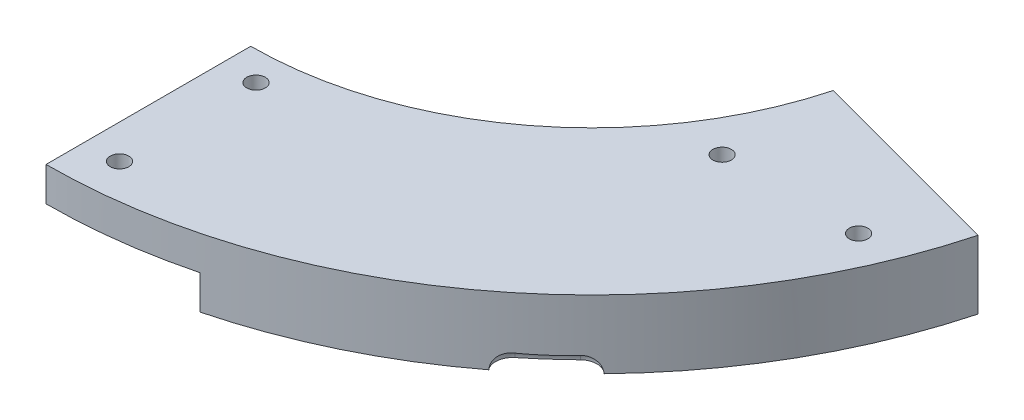
ISO-10303-21;
HEADER;
FILE_DESCRIPTION(('STEP AP214'),'2;1');
FILE_NAME('part.step','',(''),(''),'','','');
FILE_SCHEMA(('AUTOMOTIVE_DESIGN { 1 0 10303 214 1 1 1 1 }'));
ENDSEC;
DATA;
#1=APPLICATION_CONTEXT('core data for automotive mechanical design processes');
#2=APPLICATION_PROTOCOL_DEFINITION('international standard','automotive_design',2000,#1);
#3=PRODUCT_CONTEXT('',#1,'mechanical');
#4=PRODUCT('Part','Part','',(#3));
#5=PRODUCT_RELATED_PRODUCT_CATEGORY('part','',(#4));
#6=PRODUCT_DEFINITION_FORMATION('','',#4);
#7=PRODUCT_DEFINITION_CONTEXT('part definition',#1,'design');
#8=PRODUCT_DEFINITION('design','',#6,#7);
#9=PRODUCT_DEFINITION_SHAPE('','',#8);
#10=(LENGTH_UNIT() NAMED_UNIT(*) SI_UNIT(.MILLI.,.METRE.));
#11=(NAMED_UNIT(*) PLANE_ANGLE_UNIT() SI_UNIT($,.RADIAN.));
#12=(NAMED_UNIT(*) SI_UNIT($,.STERADIAN.) SOLID_ANGLE_UNIT());
#13=UNCERTAINTY_MEASURE_WITH_UNIT(LENGTH_MEASURE(1.E-05),#10,'distance_accuracy_value','');
#14=(GEOMETRIC_REPRESENTATION_CONTEXT(3) GLOBAL_UNCERTAINTY_ASSIGNED_CONTEXT((#13)) GLOBAL_UNIT_ASSIGNED_CONTEXT((#10,
#11,#12)) REPRESENTATION_CONTEXT('',''));
#15=CARTESIAN_POINT('',(0.,0.,0.));
#16=DIRECTION('',(0.,0.,1.));
#17=DIRECTION('',(1.,0.,0.));
#18=AXIS2_PLACEMENT_3D('',#15,#16,#17);
#19=CARTESIAN_POINT('',(0.,-6.35,0.));
#20=DIRECTION('',(0.,1.,0.));
#21=DIRECTION('',(0.,0.,1.));
#22=AXIS2_PLACEMENT_3D('',#19,#20,#21);
#23=PLANE('',#22);
#24=CARTESIAN_POINT('',(-6.34999999999999,-6.35,-94.267465262));
#25=DIRECTION('',(0.,1.,0.));
#26=DIRECTION('',(0.,0.,1.));
#27=AXIS2_PLACEMENT_3D('',#24,#25,#26);
#28=CIRCLE('',#27,101.6);
#29=CARTESIAN_POINT('',(91.7880639509695,-6.35,-67.9714502795843));
#30=VERTEX_POINT('',#29);
#31=CARTESIAN_POINT('',(66.609934624812,-6.35,-23.5609737669247));
#32=VERTEX_POINT('',#31);
#33=EDGE_CURVE('E161',#30,#32,#28,.F.);
#34=ORIENTED_EDGE('',*,*,#33,.T.);
#35=CARTESIAN_POINT('',(64.3650015378368,-6.35,-21.3157788010022));
#36=DIRECTION('',(0.,1.,0.));
#37=DIRECTION('',(0.,0.,1.));
#38=AXIS2_PLACEMENT_3D('',#35,#36,#37);
#39=CIRCLE('',#38,3.17500000000001);
#40=CARTESIAN_POINT('',(62.1551577397794,-6.35,-23.5955190029084));
#41=VERTEX_POINT('',#40);
#42=EDGE_CURVE('E147',#32,#41,#39,.T.);
#43=ORIENTED_EDGE('',*,*,#42,.T.);
#44=CARTESIAN_POINT('',(-6.34999999999999,-6.35,-94.267465262));
#45=DIRECTION('',(0.,1.,0.));
#46=DIRECTION('',(0.,0.,1.));
#47=AXIS2_PLACEMENT_3D('',#44,#45,#46);
#48=CIRCLE('',#47,98.425);
#49=CARTESIAN_POINT('',(55.7350089646732,-6.35,-17.8938291900122));
#50=VERTEX_POINT('',#49);
#51=EDGE_CURVE('E398',#41,#50,#48,.F.);
#52=ORIENTED_EDGE('',*,*,#51,.T.);
#53=CARTESIAN_POINT('',(57.7377511893401,-6.35,-15.4301635102706));
#54=DIRECTION('',(0.,1.,0.));
#55=DIRECTION('',(0.,0.,1.));
#56=AXIS2_PLACEMENT_3D('',#53,#54,#55);
#57=CIRCLE('',#56,3.175);
#58=CARTESIAN_POINT('',(55.2430934211356,-6.35,-13.4661605521423));
#59=VERTEX_POINT('',#58);
#60=EDGE_CURVE('E156',#50,#59,#57,.T.);
#61=ORIENTED_EDGE('',*,*,#60,.T.);
#62=CARTESIAN_POINT('',(19.05,-6.35,4.1063117316684));
#63=VERTEX_POINT('',#62);
#64=EDGE_CURVE('E170',#59,#63,#28,.F.);
#65=ORIENTED_EDGE('',*,*,#64,.T.);
#66=DIRECTION('',(0.,0.,-1.));
#67=VECTOR('',#66,1.);
#68=CARTESIAN_POINT('',(19.05,-6.35,0.));
#69=LINE('',#68,#67);
#70=CARTESIAN_POINT('',(19.05,-6.35000000000001,-9.32758866940955));
#71=VERTEX_POINT('',#70);
#72=EDGE_CURVE('E176',#63,#71,#69,.T.);
#73=ORIENTED_EDGE('',*,*,#72,.T.);
#74=CARTESIAN_POINT('',(59.2307860808822,-6.34999999999998,-34.6092496575072));
#75=CARTESIAN_POINT('',(53.9014840663634,-6.34999999999998,-28.753781836006));
#76=CARTESIAN_POINT('',(47.7126525344251,-6.34999999999998,-23.5402136265929));
#77=CARTESIAN_POINT('',(34.0840577834186,-6.34999999999998,-14.9609190133976));
#78=CARTESIAN_POINT('',(26.6877525453769,-6.34999999999671,-11.6096261559123));
#79=CARTESIAN_POINT('',(18.6746195889176,-6.35000000000014,-9.21543378527847));
#80=CARTESIAN_POINT('',(18.296166475289,-6.34999999999998,-9.10439786983044));
#81=CARTESIAN_POINT('',(17.9206079167567,-6.34999999999998,-8.99642515905449));
#82=B_SPLINE_CURVE_WITH_KNOTS('',3,(#74,#75,#76,#77,#78,#79,#80,#81),.UNSPECIFIED.,.F.,.F.,(4,2,
2,4),(0.,0.488007694164067,0.976015388328135,1.),.UNSPECIFIED.);
#83=CARTESIAN_POINT('',(59.2307860808822,-6.34999999999999,-34.6092496575072));
#84=VERTEX_POINT('',#83);
#85=EDGE_CURVE('E298',#84,#71,#82,.T.);
#86=ORIENTED_EDGE('',*,*,#85,.F.);
#87=DIRECTION('',(0.515920464794379,0.,0.856636488836631));
#88=VECTOR('',#87,1.);
#89=CARTESIAN_POINT('',(64.0430813094094,-6.35,-26.6188946142084));
#90=LINE('',#89,#88);
#91=CARTESIAN_POINT('',(54.063522539709,-6.35,-43.1889955657612));
#92=VERTEX_POINT('',#91);
#93=EDGE_CURVE('E306',#92,#84,#90,.T.);
#94=ORIENTED_EDGE('',*,*,#93,.F.);
#95=CARTESIAN_POINT('',(54.063522539709,-6.34999999999998,-43.1889955657612));
#96=CARTESIAN_POINT('',(49.5107747784138,-6.34999999999998,-37.8008034006709));
#97=CARTESIAN_POINT('',(44.1383057302959,-6.34999999999998,-32.9416564163539));
#98=CARTESIAN_POINT('',(32.2865263150446,-6.34999999999998,-24.8569769230008));
#99=CARTESIAN_POINT('',(25.7750626710049,-6.34999999999998,-21.6252465632108));
#100=CARTESIAN_POINT('',(18.7194764886662,-6.34999999999998,-19.2310542036305));
#101=CARTESIAN_POINT('',(18.3817175174875,-6.34999999999998,-19.1197151915227));
#102=CARTESIAN_POINT('',(18.0455634429701,-6.34999999999998,-19.011266069953));
#103=B_SPLINE_CURVE_WITH_KNOTS('',3,(#95,#96,#97,#98,#99,#100,#101,#102),.UNSPECIFIED.,.F.,.F.,
(4,2,2,4),(0.,0.488007694164067,0.976015388328135,1.),.UNSPECIFIED.);
#104=CARTESIAN_POINT('',(19.0499998347804,-6.35,-19.3432110988143));
#105=VERTEX_POINT('',#104);
#106=EDGE_CURVE('E76',#92,#105,#103,.T.);
#107=ORIENTED_EDGE('',*,*,#106,.T.);
#108=CARTESIAN_POINT('',(19.05,-6.35,-29.179965262));
#109=VERTEX_POINT('',#108);
#110=EDGE_CURVE('E254',#105,#109,#69,.T.);
#111=ORIENTED_EDGE('',*,*,#110,.T.);
#112=CARTESIAN_POINT('',(19.05,-6.35,-30.767465262));
#113=DIRECTION('',(0.,1.,0.));
#114=DIRECTION('',(0.,0.,1.));
#115=AXIS2_PLACEMENT_3D('',#112,#113,#114);
#116=CIRCLE('',#115,1.5875);
#117=CARTESIAN_POINT('',(17.6278728360681,-6.35,-31.472951321116));
#118=VERTEX_POINT('',#117);
#119=EDGE_CURVE('E257',#118,#109,#116,.F.);
#120=ORIENTED_EDGE('',*,*,#119,.F.);
#121=DIRECTION('',(-0.895828134760231,0.,-0.444400667159721));
#122=VECTOR('',#121,1.);
#123=CARTESIAN_POINT('',(16.0109533285498,-6.35,-32.2750695846567));
#124=LINE('',#123,#122);
#125=CARTESIAN_POINT('',(12.9770144535497,-6.35,-33.7801400416509));
#126=VERTEX_POINT('',#125);
#127=EDGE_CURVE('E197',#118,#126,#124,.T.);
#128=ORIENTED_EDGE('',*,*,#127,.T.);
#129=CARTESIAN_POINT('',(-6.34999999999999,-6.35,-94.267465262));
#130=DIRECTION('',(0.,1.,0.));
#131=DIRECTION('',(0.,0.,1.));
#132=AXIS2_PLACEMENT_3D('',#129,#130,#131);
#133=CIRCLE('',#132,63.5);
#134=CARTESIAN_POINT('',(54.9862899693559,-6.35,-77.8324558979902));
#135=VERTEX_POINT('',#134);
#136=EDGE_CURVE('E174',#135,#126,#133,.F.);
#137=ORIENTED_EDGE('',*,*,#136,.F.);
#138=DIRECTION('',(-0.965925826289069,0.,-0.258819045102517));
#139=VECTOR('',#138,1.);
#140=CARTESIAN_POINT('',(23.1414969725153,-6.35,-86.3652424646298));
#141=LINE('',#140,#139);
#142=EDGE_CURVE('E168',#30,#135,#141,.T.);
#143=ORIENTED_EDGE('',*,*,#142,.F.);
#144=EDGE_LOOP('',(#34,#43,#52,#61,#65,#73,#86,#94,#107,#111,#120,#128,#137,#143));
#145=FACE_BOUND('',#144,.T.);
#146=CARTESIAN_POINT('',(80.391,-6.35,-57.15));
#147=DIRECTION('',(0.,-1.,0.));
#148=DIRECTION('',(0.,0.,-1.));
#149=AXIS2_PLACEMENT_3D('',#146,#147,#148);
#150=CIRCLE('',#149,1.72719999999998);
#151=CARTESIAN_POINT('',(80.391,-6.35,-58.8772));
#152=VERTEX_POINT('',#151);
#153=EDGE_CURVE('E427',#152,#152,#150,.T.);
#154=ORIENTED_EDGE('',*,*,#153,.F.);
#155=EDGE_LOOP('',(#154));
#156=FACE_BOUND('',#155,.T.);
#157=CARTESIAN_POINT('',(54.991,-6.35,-57.15));
#158=DIRECTION('',(0.,-1.,0.));
#159=DIRECTION('',(0.,0.,-1.));
#160=AXIS2_PLACEMENT_3D('',#157,#158,#159);
#161=CIRCLE('',#160,1.72719999999999);
#162=CARTESIAN_POINT('',(54.991,-6.35,-58.8772));
#163=VERTEX_POINT('',#162);
#164=EDGE_CURVE('E435',#163,#163,#161,.T.);
#165=ORIENTED_EDGE('',*,*,#164,.F.);
#166=EDGE_LOOP('',(#165));
#167=FACE_BOUND('',#166,.T.);
#168=ADVANCED_FACE('F49',(#145,#156,#167),#23,.F.);
#169=CARTESIAN_POINT('',(19.05,-6.35,0.));
#170=DIRECTION('',(1.,0.,0.));
#171=DIRECTION('',(0.,0.,-1.));
#172=AXIS2_PLACEMENT_3D('',#169,#170,#171);
#173=PLANE('',#172);
#174=CARTESIAN_POINT('',(19.05,-6.34999999999998,-9.32759127987919));
#175=CARTESIAN_POINT('',(19.05,-6.34877044993828,-9.43975511956092));
#176=CARTESIAN_POINT('',(19.05,-6.34691619703676,-9.55193077200282));
#177=CARTESIAN_POINT('',(19.05,-6.34099239613251,-9.77726515650753));
#178=CARTESIAN_POINT('',(19.05,-6.33690239360589,-9.89042332273259));
#179=CARTESIAN_POINT('',(19.05,-6.3255017358533,-10.1171280988849));
#180=CARTESIAN_POINT('',(19.05,-6.31817588974514,-10.2306740040092));
#181=CARTESIAN_POINT('',(19.05,-6.29910536732891,-10.4575383845618));
#182=CARTESIAN_POINT('',(19.05,-6.28735576226616,-10.5708564640558));
#183=CARTESIAN_POINT('',(19.05,-6.25878012851775,-10.792168942808));
#184=CARTESIAN_POINT('',(19.05,-6.24218087419835,-10.9001918510583));
#185=CARTESIAN_POINT('',(19.05,-6.20277258175003,-11.1148203313904));
#186=CARTESIAN_POINT('',(19.05,-6.17998032744271,-11.2214289290464));
#187=CARTESIAN_POINT('',(19.05,-6.12743804971736,-11.432669678993));
#188=CARTESIAN_POINT('',(19.05,-6.09770431840141,-11.5373058485731));
#189=CARTESIAN_POINT('',(19.05,-6.03089201337944,-11.7441343909997));
#190=CARTESIAN_POINT('',(19.05,-5.99381898811404,-11.8463285449785));
#191=CARTESIAN_POINT('',(19.05,-5.92559448921612,-12.0151972175897));
#192=CARTESIAN_POINT('',(19.05,-5.89640437976236,-12.0826722141205));
#193=CARTESIAN_POINT('',(19.05,-5.83483658282869,-12.2162040070094));
#194=CARTESIAN_POINT('',(19.05,-5.80245694374324,-12.282259904565));
#195=CARTESIAN_POINT('',(19.05,-5.73474200887846,-12.4128013177297));
#196=CARTESIAN_POINT('',(19.05,-5.699407864708,-12.4772874326718));
#197=CARTESIAN_POINT('',(19.05,-5.62588151295779,-12.6049654701701));
#198=CARTESIAN_POINT('',(19.05,-5.5876780601153,-12.6681509163208));
#199=CARTESIAN_POINT('',(19.05,-5.50876580347631,-12.7929237672376));
#200=CARTESIAN_POINT('',(19.05,-5.46805698622041,-12.8545111634161));
#201=CARTESIAN_POINT('',(19.05,-5.38560136866745,-12.9769895708319));
#202=CARTESIAN_POINT('',(19.05,-5.343854367624,-13.0378804440114));
#203=CARTESIAN_POINT('',(19.05,-5.26442749027631,-13.1542428387078));
#204=CARTESIAN_POINT('',(19.05,-5.22672578492974,-13.2096991614335));
#205=CARTESIAN_POINT('',(19.05,-5.15245577009184,-13.3213847345521));
#206=CARTESIAN_POINT('',(19.05,-5.11588761597703,-13.3776140893936));
#207=CARTESIAN_POINT('',(19.05,-5.04504274545358,-13.4913577568436));
#208=CARTESIAN_POINT('',(19.05,-5.01076135869607,-13.5488691091202));
#209=CARTESIAN_POINT('',(19.05,-4.94581968454603,-13.6658741605996));
#210=CARTESIAN_POINT('',(19.05,-4.91515686880926,-13.72536643799));
#211=CARTESIAN_POINT('',(19.05,-4.85812485743782,-13.8496229488073));
#212=CARTESIAN_POINT('',(19.05,-4.83199803778249,-13.9145038974147));
#213=CARTESIAN_POINT('',(19.05,-4.79969194226115,-14.0140103700586));
#214=CARTESIAN_POINT('',(19.05,-4.790075334711,-14.0475168825955));
#215=CARTESIAN_POINT('',(19.05,-4.77360863456636,-14.1152117216461));
#216=CARTESIAN_POINT('',(19.05,-4.76675795713493,-14.1493999024197));
#217=CARTESIAN_POINT('',(19.05,-4.75706545039511,-14.2133029068063));
#218=CARTESIAN_POINT('',(19.05,-4.75378751840878,-14.2429506243572));
#219=CARTESIAN_POINT('',(19.05,-4.74992970234322,-14.3024139100861));
#220=CARTESIAN_POINT('',(19.05,-4.74934872913819,-14.3322294056383));
#221=CARTESIAN_POINT('',(19.05,-4.75182059526889,-14.4214142277704));
#222=CARTESIAN_POINT('',(19.05,-4.75906226125519,-14.4806839274736));
#223=CARTESIAN_POINT('',(19.05,-4.78757401654163,-14.6238848869327));
#224=CARTESIAN_POINT('',(19.05,-4.81372536447771,-14.7067765502434));
#225=CARTESIAN_POINT('',(19.05,-4.86164012074288,-14.8278629908574));
#226=CARTESIAN_POINT('',(19.05,-4.87918561175012,-14.8679030807019));
#227=CARTESIAN_POINT('',(19.05,-4.91652810011912,-14.9469032558564));
#228=CARTESIAN_POINT('',(19.05,-4.93632365352685,-14.9858640140702));
#229=CARTESIAN_POINT('',(19.05,-4.98011961530697,-15.0675334919055));
#230=CARTESIAN_POINT('',(19.05,-5.00433874289198,-15.1101229729653));
#231=CARTESIAN_POINT('',(19.05,-5.05431162869136,-15.1943965989881));
#232=CARTESIAN_POINT('',(19.05,-5.08006568384121,-15.2360805666353));
#233=CARTESIAN_POINT('',(19.05,-5.15893743845551,-15.3602360841168));
#234=CARTESIAN_POINT('',(19.05,-5.21360756423976,-15.4417104588864));
#235=CARTESIAN_POINT('',(19.05,-5.29639571516648,-15.5634645692969));
#236=CARTESIAN_POINT('',(19.05,-5.32414629891594,-15.6040074659781));
#237=CARTESIAN_POINT('',(19.05,-5.37953878549608,-15.6851715569525));
#238=CARTESIAN_POINT('',(19.05,-5.40718068510752,-15.7257927535127));
#239=CARTESIAN_POINT('',(19.05,-5.46199615984555,-15.8073883751621));
#240=CARTESIAN_POINT('',(19.05,-5.4891694387988,-15.8483630007325));
#241=CARTESIAN_POINT('',(19.05,-5.54253718739959,-15.9309449283161));
#242=CARTESIAN_POINT('',(19.05,-5.56873171855971,-15.9725521903371));
#243=CARTESIAN_POINT('',(19.05,-5.61954362028558,-16.0557998323216));
#244=CARTESIAN_POINT('',(19.05,-5.64417963704127,-16.0974288118073));
#245=CARTESIAN_POINT('',(19.05,-5.69227707343041,-16.1813613435385));
#246=CARTESIAN_POINT('',(19.05,-5.71573842689181,-16.2236649336101));
#247=CARTESIAN_POINT('',(19.05,-5.78426143731401,-16.3516261481783));
#248=CARTESIAN_POINT('',(19.05,-5.82744325539144,-16.4383036054415));
#249=CARTESIAN_POINT('',(19.05,-5.90826895682044,-16.6141382494852));
#250=CARTESIAN_POINT('',(19.05,-5.9459161908351,-16.7032938967552));
#251=CARTESIAN_POINT('',(19.05,-6.0153723510886,-16.883728164841));
#252=CARTESIAN_POINT('',(19.05,-6.04718852397859,-16.9750039895342));
#253=CARTESIAN_POINT('',(19.05,-6.09815420517401,-17.1374463040669));
#254=CARTESIAN_POINT('',(19.05,-6.11851696899575,-17.2082359991626));
#255=CARTESIAN_POINT('',(19.05,-6.15599581587932,-17.350672464299));
#256=CARTESIAN_POINT('',(19.05,-6.17311173894412,-17.4223192763918));
#257=CARTESIAN_POINT('',(19.05,-6.20430963450578,-17.5663336381067));
#258=CARTESIAN_POINT('',(19.05,-6.21838885287876,-17.6387017802318));
#259=CARTESIAN_POINT('',(19.05,-6.24378437073793,-17.7840156327186));
#260=CARTESIAN_POINT('',(19.05,-6.25509700085172,-17.8569619790708));
#261=CARTESIAN_POINT('',(19.05,-6.27526724099159,-18.0032815814091));
#262=CARTESIAN_POINT('',(19.05,-6.2841217823838,-18.0766552552952));
#263=CARTESIAN_POINT('',(19.05,-6.30033791486185,-18.2296630303017));
#264=CARTESIAN_POINT('',(19.05,-6.30751708297262,-18.3093162127117));
#265=CARTESIAN_POINT('',(19.05,-6.31980546301345,-18.4687530121299));
#266=CARTESIAN_POINT('',(19.05,-6.32491532103713,-18.5485365806043));
#267=CARTESIAN_POINT('',(19.05,-6.33346530599267,-18.7080501494635));
#268=CARTESIAN_POINT('',(19.05,-6.33690834883233,-18.7877799979509));
#269=CARTESIAN_POINT('',(19.05,-6.34249665501377,-18.9470020855166));
#270=CARTESIAN_POINT('',(19.05,-6.34464643971849,-19.0264941741518));
#271=CARTESIAN_POINT('',(19.05,-6.34796911453025,-19.1850615902752));
#272=CARTESIAN_POINT('',(19.05,-6.349147317236,-19.2641368030509));
#273=CARTESIAN_POINT('',(19.05,-6.34999999999998,-19.3432116977134));
#274=B_SPLINE_CURVE_WITH_KNOTS('',3,(#174,#175,#176,#177,#178,#179,#180,#181,#182,#183,#184,
#185,#186,#187,#188,#189,#190,#191,#192,#193,#194,#195,#196,#197,#198,#199,#200,#201,#202,#203,
#204,#205,#206,#207,#208,#209,#210,#211,#212,#213,#214,#215,#216,#217,#218,#219,#220,#221,#222,
#223,#224,#225,#226,#227,#228,#229,#230,#231,#232,#233,#234,#235,#236,#237,#238,#239,#240,#241,
#242,#243,#244,#245,#246,#247,#248,#249,#250,#251,#252,#253,#254,#255,#256,#257,#258,#259,#260,
#261,#262,#263,#264,#265,#266,#267,#268,#269,#270,#271,#272,#273),.UNSPECIFIED.,.F.,.F.,(4,2,2,
2,2,2,2,2,2,2,2,2,2,2,2,2,2,2,2,2,2,2,2,2,2,2,2,2,2,2,2,2,2,2,2,2,2,2,2,2,2,2,2,2,2,2,2,2,2,4),
(0.,0.33653894471456,0.676209654337335,1.01749220520341,1.35915612850659,1.68687464878332,
2.01371371910203,2.33979325492401,2.66562721247959,2.88610421286083,3.10671696647942,
3.32724412682608,3.54868585943983,3.77012878179348,3.99161486117681,4.19278570974306,
4.39398401206495,4.59475795350605,4.79539077033413,5.00468131198282,5.10916671579987,
5.21363001531121,5.30300516352542,5.39234421580322,5.57053841702862,5.82975187467556,
5.9608693111356,6.09190307442065,6.2388452307864,6.3858159063228,6.68010434116102,
6.82750058248743,6.97490115732465,7.1223917081208,7.26987297374777,7.41497097012355,
7.56007713109804,7.85039704617334,8.14054046994653,8.43032083104868,8.65122560558994,
8.87214126299623,9.09325644400447,9.31466332236302,9.53634537071466,9.77624018987288,
10.0160600496339,10.2554588414096,10.4940157314633,10.7312593800441),.UNSPECIFIED.);
#275=EDGE_CURVE('E190',#71,#105,#274,.T.);
#276=ORIENTED_EDGE('',*,*,#275,.F.);
#277=ORIENTED_EDGE('',*,*,#72,.F.);
#278=DIRECTION('',(0.,1.,0.));
#279=VECTOR('',#278,1.);
#280=CARTESIAN_POINT('',(19.05,-6.35,4.1063117316684));
#281=LINE('',#280,#279);
#282=CARTESIAN_POINT('',(19.05,0.,4.10631173166838));
#283=VERTEX_POINT('',#282);
#284=EDGE_CURVE('E203',#63,#283,#281,.T.);
#285=ORIENTED_EDGE('',*,*,#284,.T.);
#286=DIRECTION('',(0.,0.,-1.));
#287=VECTOR('',#286,1.);
#288=CARTESIAN_POINT('',(19.05,0.,0.));
#289=LINE('',#288,#287);
#290=CARTESIAN_POINT('',(19.05,0.,-29.179965262));
#291=VERTEX_POINT('',#290);
#292=EDGE_CURVE('E193',#283,#291,#289,.T.);
#293=ORIENTED_EDGE('',*,*,#292,.T.);
#294=DIRECTION('',(0.,1.,0.));
#295=VECTOR('',#294,1.);
#296=CARTESIAN_POINT('',(19.05,-6.35,-29.179965262));
#297=LINE('',#296,#295);
#298=EDGE_CURVE('E207',#109,#291,#297,.T.);
#299=ORIENTED_EDGE('',*,*,#298,.F.);
#300=ORIENTED_EDGE('',*,*,#110,.F.);
#301=EDGE_LOOP('',(#276,#277,#285,#293,#299,#300));
#302=FACE_BOUND('',#301,.T.);
#303=ADVANCED_FACE('F346',(#302),#173,.F.);
#304=CARTESIAN_POINT('',(0.,0.,0.));
#305=DIRECTION('',(0.,1.,0.));
#306=DIRECTION('',(0.,0.,1.));
#307=AXIS2_PLACEMENT_3D('',#304,#305,#306);
#308=PLANE('',#307);
#309=CARTESIAN_POINT('',(0.,0.,0.));
#310=DIRECTION('',(0.,1.,0.));
#311=DIRECTION('',(0.,0.,1.));
#312=AXIS2_PLACEMENT_3D('',#309,#310,#311);
#313=CIRCLE('',#312,1.72719999999999);
#314=CARTESIAN_POINT('',(0.,0.,1.72719999999999));
#315=VERTEX_POINT('',#314);
#316=EDGE_CURVE('E415',#315,#315,#313,.T.);
#317=ORIENTED_EDGE('',*,*,#316,.T.);
#318=EDGE_LOOP('',(#317));
#319=FACE_BOUND('',#318,.T.);
#320=CARTESIAN_POINT('',(0.,0.,-25.4));
#321=DIRECTION('',(0.,1.,0.));
#322=DIRECTION('',(0.,0.,1.));
#323=AXIS2_PLACEMENT_3D('',#320,#321,#322);
#324=CIRCLE('',#323,1.72719999999999);
#325=CARTESIAN_POINT('',(0.,0.,-23.6728));
#326=VERTEX_POINT('',#325);
#327=EDGE_CURVE('E403',#326,#326,#324,.T.);
#328=ORIENTED_EDGE('',*,*,#327,.T.);
#329=EDGE_LOOP('',(#328));
#330=FACE_BOUND('',#329,.T.);
#331=DIRECTION('',(-0.895828134760231,0.,-0.444400667159721));
#332=VECTOR('',#331,1.);
#333=CARTESIAN_POINT('',(16.0109533285498,0.,-32.2750695846567));
#334=LINE('',#333,#332);
#335=CARTESIAN_POINT('',(17.6278728360681,0.,-31.472951321116));
#336=VERTEX_POINT('',#335);
#337=CARTESIAN_POINT('',(12.9770144535497,0.,-33.7801400416509));
#338=VERTEX_POINT('',#337);
#339=EDGE_CURVE('E185',#336,#338,#334,.T.);
#340=ORIENTED_EDGE('',*,*,#339,.F.);
#341=CARTESIAN_POINT('',(19.05,0.,-30.767465262));
#342=DIRECTION('',(0.,1.,0.));
#343=DIRECTION('',(0.,0.,1.));
#344=AXIS2_PLACEMENT_3D('',#341,#342,#343);
#345=CIRCLE('',#344,1.5875);
#346=EDGE_CURVE('E189',#336,#291,#345,.F.);
#347=ORIENTED_EDGE('',*,*,#346,.T.);
#348=ORIENTED_EDGE('',*,*,#292,.F.);
#349=CARTESIAN_POINT('',(-6.34999999999999,0.,-94.267465262));
#350=DIRECTION('',(0.,1.,0.));
#351=DIRECTION('',(0.,0.,1.));
#352=AXIS2_PLACEMENT_3D('',#349,#350,#351);
#353=CIRCLE('',#352,101.6);
#354=CARTESIAN_POINT('',(-6.35,0.,7.332534738));
#355=VERTEX_POINT('',#354);
#356=EDGE_CURVE('E218',#283,#355,#353,.F.);
#357=ORIENTED_EDGE('',*,*,#356,.T.);
#358=DIRECTION('',(0.,0.,-1.));
#359=VECTOR('',#358,1.);
#360=CARTESIAN_POINT('',(-6.35,0.,0.));
#361=LINE('',#360,#359);
#362=CARTESIAN_POINT('',(-6.35,0.,-30.767465262));
#363=VERTEX_POINT('',#362);
#364=EDGE_CURVE('E232',#355,#363,#361,.T.);
#365=ORIENTED_EDGE('',*,*,#364,.T.);
#366=CARTESIAN_POINT('',(-6.34999999999999,0.,-94.267465262));
#367=DIRECTION('',(0.,1.,0.));
#368=DIRECTION('',(0.,0.,1.));
#369=AXIS2_PLACEMENT_3D('',#366,#367,#368);
#370=CIRCLE('',#369,63.5);
#371=EDGE_CURVE('E202',#338,#363,#370,.F.);
#372=ORIENTED_EDGE('',*,*,#371,.F.);
#373=EDGE_LOOP('',(#340,#347,#348,#357,#365,#372));
#374=FACE_BOUND('',#373,.T.);
#375=ADVANCED_FACE('F351',(#319,#330,#374),#308,.F.);
#376=CARTESIAN_POINT('',(-6.34999999999999,6.35,-94.267465262));
#377=DIRECTION('',(0.,-1.,0.));
#378=DIRECTION('',(0.,0.,-1.));
#379=AXIS2_PLACEMENT_3D('',#376,#377,#378);
#380=CYLINDRICAL_SURFACE('',#379,63.5);
#381=DIRECTION('',(0.,-1.,0.));
#382=VECTOR('',#381,1.);
#383=CARTESIAN_POINT('',(54.9862899693559,6.35,-77.8324558979902));
#384=LINE('',#383,#382);
#385=CARTESIAN_POINT('',(54.9862899693559,6.35,-77.8324558979902));
#386=VERTEX_POINT('',#385);
#387=EDGE_CURVE('E229',#386,#135,#384,.T.);
#388=ORIENTED_EDGE('',*,*,#387,.T.);
#389=ORIENTED_EDGE('',*,*,#136,.T.);
#390=DIRECTION('',(0.,1.,0.));
#391=VECTOR('',#390,1.);
#392=CARTESIAN_POINT('',(12.9770144535497,-6.35,-33.7801400416509));
#393=LINE('',#392,#391);
#394=EDGE_CURVE('E198',#126,#338,#393,.T.);
#395=ORIENTED_EDGE('',*,*,#394,.T.);
#396=ORIENTED_EDGE('',*,*,#371,.T.);
#397=DIRECTION('',(0.,-1.,0.));
#398=VECTOR('',#397,1.);
#399=CARTESIAN_POINT('',(-6.35,6.35,-30.767465262));
#400=LINE('',#399,#398);
#401=CARTESIAN_POINT('',(-6.35,6.35,-30.767465262));
#402=VERTEX_POINT('',#401);
#403=EDGE_CURVE('E247',#402,#363,#400,.T.);
#404=ORIENTED_EDGE('',*,*,#403,.F.);
#405=CARTESIAN_POINT('',(-6.34999999999999,6.35,-94.267465262));
#406=DIRECTION('',(0.,1.,0.));
#407=DIRECTION('',(0.,0.,1.));
#408=AXIS2_PLACEMENT_3D('',#405,#406,#407);
#409=CIRCLE('',#408,63.5);
#410=EDGE_CURVE('E214',#386,#402,#409,.F.);
#411=ORIENTED_EDGE('',*,*,#410,.F.);
#412=EDGE_LOOP('',(#388,#389,#395,#396,#404,#411));
#413=FACE_BOUND('',#412,.T.);
#414=ADVANCED_FACE('F51',(#413),#380,.F.);
#415=CARTESIAN_POINT('',(-6.35,6.35,0.));
#416=DIRECTION('',(-1.,0.,0.));
#417=DIRECTION('',(0.,0.,1.));
#418=AXIS2_PLACEMENT_3D('',#415,#416,#417);
#419=PLANE('',#418);
#420=ORIENTED_EDGE('',*,*,#364,.F.);
#421=DIRECTION('',(0.,-1.,0.));
#422=VECTOR('',#421,1.);
#423=CARTESIAN_POINT('',(-6.35,6.35,7.332534738));
#424=LINE('',#423,#422);
#425=CARTESIAN_POINT('',(-6.35,6.35,7.332534738));
#426=VERTEX_POINT('',#425);
#427=EDGE_CURVE('E243',#426,#355,#424,.T.);
#428=ORIENTED_EDGE('',*,*,#427,.F.);
#429=DIRECTION('',(0.,0.,-1.));
#430=VECTOR('',#429,1.);
#431=CARTESIAN_POINT('',(-6.35,6.35,0.));
#432=LINE('',#431,#430);
#433=EDGE_CURVE('E217',#426,#402,#432,.T.);
#434=ORIENTED_EDGE('',*,*,#433,.T.);
#435=ORIENTED_EDGE('',*,*,#403,.T.);
#436=EDGE_LOOP('',(#420,#428,#434,#435));
#437=FACE_BOUND('',#436,.T.);
#438=ADVANCED_FACE('F357',(#437),#419,.T.);
#439=CARTESIAN_POINT('',(-6.34999999999999,6.35,-94.267465262));
#440=DIRECTION('',(0.,-1.,0.));
#441=DIRECTION('',(0.,0.,-1.));
#442=AXIS2_PLACEMENT_3D('',#439,#440,#441);
#443=CYLINDRICAL_SURFACE('',#442,101.6);
#444=CARTESIAN_POINT('',(66.609934624812,-6.35,-23.5609737669247));
#445=CARTESIAN_POINT('',(66.6099322914893,-6.34994364609906,-23.5609713592381));
#446=CARTESIAN_POINT('',(66.6099299571175,-6.34988729228781,-23.5609689504691));
#447=CARTESIAN_POINT('',(66.6099248637704,-6.34976438979028,-23.5609636947962));
#448=CARTESIAN_POINT('',(66.6099221043813,-6.34969784113942,-23.5609608474652));
#449=CARTESIAN_POINT('',(66.6099083001211,-6.34936509850946,-23.5609466032641));
#450=CARTESIAN_POINT('',(66.6098972333061,-6.34909890640943,-23.5609351837557));
#451=CARTESIAN_POINT('',(66.6098417821869,-6.34776795584443,-23.5608779654664));
#452=CARTESIAN_POINT('',(66.6097970467666,-6.34670322756747,-23.5608318044602));
#453=CARTESIAN_POINT('',(66.6095714970101,-6.34137974133681,-23.5605990675512));
#454=CARTESIAN_POINT('',(66.6093850657219,-6.33712147331932,-23.5604066970603));
#455=CARTESIAN_POINT('',(66.6084229261323,-6.31583238417126,-23.5594139144745));
#456=CARTESIAN_POINT('',(66.6075573332808,-6.29880988236194,-23.5585207789504));
#457=CARTESIAN_POINT('',(66.602748826577,-6.21371808089179,-23.5535594933934));
#458=CARTESIAN_POINT('',(66.5973684472175,-6.14581136006388,-23.548008814251));
#459=CARTESIAN_POINT('',(66.5765108152607,-5.94172994844239,-23.5264979811647));
#460=CARTESIAN_POINT('',(66.5563314044495,-5.80648405768621,-23.5056939519115));
#461=CARTESIAN_POINT('',(66.5038038860815,-5.54075442330828,-23.4516148939714));
#462=CARTESIAN_POINT('',(66.4714346009867,-5.41027940345451,-23.4183181620159));
#463=CARTESIAN_POINT('',(66.3839729961097,-5.11985097457476,-23.3285184349577));
#464=CARTESIAN_POINT('',(66.325020931578,-4.96223381886496,-23.2680934558307));
#465=CARTESIAN_POINT('',(66.1892452842781,-4.66340618695287,-23.1293793470612));
#466=CARTESIAN_POINT('',(66.1124164919602,-4.52220051132612,-23.0510850101442));
#467=CARTESIAN_POINT('',(65.9429151001209,-4.26019405716668,-22.8790280087301));
#468=CARTESIAN_POINT('',(65.8502432829186,-4.13939227168721,-22.7852661080201));
#469=CARTESIAN_POINT('',(65.6515286038279,-3.92162111688283,-22.5851122924166));
#470=CARTESIAN_POINT('',(65.5454865356497,-3.82465033386348,-22.4787211272675));
#471=CARTESIAN_POINT('',(65.322792157992,-3.65719560851525,-22.2563854993817));
#472=CARTESIAN_POINT('',(65.2061313591349,-3.58673309394027,-22.1404334000402));
#473=CARTESIAN_POINT('',(64.9654621875259,-3.47439528056044,-21.9024635807826));
#474=CARTESIAN_POINT('',(64.8414537493446,-3.43252023636413,-21.7804458068541));
#475=CARTESIAN_POINT('',(64.5894713895703,-3.37852672245852,-21.5338246196519));
#476=CARTESIAN_POINT('',(64.4614956179687,-3.3664223530781,-21.4092200093348));
#477=CARTESIAN_POINT('',(64.2052413492271,-3.37235396285035,-21.1610378049723));
#478=CARTESIAN_POINT('',(64.0769628450247,-3.39039065224546,-21.0374602351969));
#479=CARTESIAN_POINT('',(63.8237635569656,-3.45610336671023,-20.7947922790382));
#480=CARTESIAN_POINT('',(63.6988432161073,-3.50378328239999,-20.6757024838436));
#481=CARTESIAN_POINT('',(63.4560232935394,-3.62743479772165,-20.4453334658321));
#482=CARTESIAN_POINT('',(63.3381231105335,-3.70340397024412,-20.3340535739287));
#483=CARTESIAN_POINT('',(63.1128585370725,-3.88146133625808,-20.1223697098769));
#484=CARTESIAN_POINT('',(63.0054896485669,-3.98353831097401,-20.0219610925484));
#485=CARTESIAN_POINT('',(62.8044275249567,-4.21094913252779,-19.8346494091779));
#486=CARTESIAN_POINT('',(62.710738098746,-4.33628943480015,-19.7477501042193));
#487=CARTESIAN_POINT('',(62.5399556482404,-4.60666299884479,-19.5898409841835));
#488=CARTESIAN_POINT('',(62.4628484075706,-4.75167921651115,-19.5188175561937));
#489=CARTESIAN_POINT('',(62.3614710783986,-4.98065386486946,-19.4256598259085));
#490=CARTESIAN_POINT('',(62.3300586702987,-5.05888905006579,-19.3968363128068));
#491=CARTESIAN_POINT('',(62.2721881088547,-5.21873291905502,-19.3437918181448));
#492=CARTESIAN_POINT('',(62.2457310324121,-5.30034233144777,-19.3195718370154));
#493=CARTESIAN_POINT('',(62.1995608988169,-5.46101324764347,-19.2773418086827));
#494=CARTESIAN_POINT('',(62.1795250935251,-5.5399047205723,-19.2590339946947));
#495=CARTESIAN_POINT('',(62.1442322127372,-5.69959821887417,-19.2268047827911));
#496=CARTESIAN_POINT('',(62.1289722924324,-5.78039907593117,-19.2128807735843));
#497=CARTESIAN_POINT('',(62.1099015636492,-5.9027846971634,-19.195486798036));
#498=CARTESIAN_POINT('',(62.1041758646726,-5.94383545741617,-19.1902659733074));
#499=CARTESIAN_POINT('',(62.0941030594114,-6.02623839177153,-19.1810829883006));
#500=CARTESIAN_POINT('',(62.0897555791013,-6.06759048097676,-19.1771204865341));
#501=CARTESIAN_POINT('',(62.0826138283686,-6.15061755135773,-19.170611872014));
#502=CARTESIAN_POINT('',(62.0798221444588,-6.19229295413468,-19.1680681179241));
#503=CARTESIAN_POINT('',(62.0761124076327,-6.27582761145253,-19.1646880609893));
#504=CARTESIAN_POINT('',(62.0751959551965,-6.31768699251008,-19.1638532166714));
#505=CARTESIAN_POINT('',(62.0753745657074,-6.35956710731994,-19.1640158369394));
#506=B_SPLINE_CURVE_WITH_KNOTS('',3,(#444,#445,#446,#447,#448,#449,#450,#451,#452,#453,#454,
#455,#456,#457,#458,#459,#460,#461,#462,#463,#464,#465,#466,#467,#468,#469,#470,#471,#472,#473,
#474,#475,#476,#477,#478,#479,#480,#481,#482,#483,#484,#485,#486,#487,#488,#489,#490,#491,#492,
#493,#494,#495,#496,#497,#498,#499,#500,#501,#502,#503,#504,#505),.UNSPECIFIED.,.F.,.F.,(4,2,2,
2,2,2,2,2,2,2,2,2,2,2,2,2,2,2,2,2,2,2,2,2,2,2,2,2,2,2,4),(0.,0.000169360655103368,
0.00036936065520296,0.00116936066158782,0.00436936107020019,0.0171693872215596,
0.0683710610821143,0.273278369852613,0.686934116924433,1.10131185086835,1.63506583019071,
2.16897554875975,2.7028589107932,3.23671059433442,3.77099289023108,4.30527994454352,
4.83982000533654,5.37437266218287,5.90899549291894,6.44357246563673,6.97792011026165,
7.51241625546349,8.04645231894399,8.31348253470207,8.58057071478212,8.83060505170835,
9.0804901682006,9.2057831915608,9.33104218332853,9.45650880174188,9.58208245931334),.UNSPECIFIED.);
#507=CARTESIAN_POINT('',(64.2654030779698,-3.37237107699846,-21.2193657101577));
#508=VERTEX_POINT('',#507);
#509=EDGE_CURVE('E11',#32,#508,#506,.T.);
#510=ORIENTED_EDGE('',*,*,#509,.F.);
#511=ORIENTED_EDGE('',*,*,#33,.F.);
#512=DIRECTION('',(0.,-1.,0.));
#513=VECTOR('',#512,1.);
#514=CARTESIAN_POINT('',(91.7880639509695,6.35,-67.9714502795843));
#515=LINE('',#514,#513);
#516=CARTESIAN_POINT('',(91.7880639509695,6.35,-67.9714502795843));
#517=VERTEX_POINT('',#516);
#518=EDGE_CURVE('E240',#517,#30,#515,.T.);
#519=ORIENTED_EDGE('',*,*,#518,.F.);
#520=CARTESIAN_POINT('',(-6.34999999999999,6.35,-94.267465262));
#521=DIRECTION('',(0.,1.,0.));
#522=DIRECTION('',(0.,0.,1.));
#523=AXIS2_PLACEMENT_3D('',#520,#521,#522);
#524=CIRCLE('',#523,101.6);
#525=EDGE_CURVE('E222',#517,#426,#524,.F.);
#526=ORIENTED_EDGE('',*,*,#525,.T.);
#527=ORIENTED_EDGE('',*,*,#427,.T.);
#528=ORIENTED_EDGE('',*,*,#356,.F.);
#529=ORIENTED_EDGE('',*,*,#284,.F.);
#530=ORIENTED_EDGE('',*,*,#64,.F.);
#531=CARTESIAN_POINT('',(55.2430934211356,-6.35,-13.4661605521423));
#532=CARTESIAN_POINT('',(55.2430960875884,-6.34994364609913,-13.4661625847218));
#533=CARTESIAN_POINT('',(55.2430987552398,-6.34988729228796,-13.4661646182152));
#534=CARTESIAN_POINT('',(55.2431045757663,-6.34976438979051,-13.4661690550781));
#535=CARTESIAN_POINT('',(55.2431077291144,-6.34969784113965,-13.4661714588082));
#536=CARTESIAN_POINT('',(55.2431235042119,-6.34936509850969,-13.4661834838305));
#537=CARTESIAN_POINT('',(55.2431361510333,-6.34909890640966,-13.466193124239));
#538=CARTESIAN_POINT('',(55.2431995188682,-6.34776795584467,-13.4662414282425));
#539=CARTESIAN_POINT('',(55.2432506410463,-6.3467032275677,-13.4662803977078));
#540=CARTESIAN_POINT('',(55.243508391496,-6.34137974133704,-13.4664768763762));
#541=CARTESIAN_POINT('',(55.2437214372871,-6.33712147331955,-13.466639278722));
#542=CARTESIAN_POINT('',(55.2448209215734,-6.3158323841715,-13.4674774100701));
#543=CARTESIAN_POINT('',(55.2458100519005,-6.29880988236224,-13.468231441399));
#544=CARTESIAN_POINT('',(55.2513046055145,-6.21371808089174,-13.4724202325948));
#545=CARTESIAN_POINT('',(55.2574519784902,-6.14581136006141,-13.4771072707323));
#546=CARTESIAN_POINT('',(55.2812760077567,-5.94172996511855,-13.4952779128129));
#547=CARTESIAN_POINT('',(55.3043180653114,-5.80648409075842,-13.5128585717461));
#548=CARTESIAN_POINT('',(55.3642232945218,-5.54075445523077,-13.5586302612845));
#549=CARTESIAN_POINT('',(55.4011105224525,-5.41027941905177,-13.5868397600532));
#550=CARTESIAN_POINT('',(55.5006129525978,-5.1198508722888,-13.6630814970759));
#551=CARTESIAN_POINT('',(55.56757862323,-4.96223362141371,-13.7144831835712));
#552=CARTESIAN_POINT('',(55.7213600380162,-4.66340600984245,-13.832922700514));
#553=CARTESIAN_POINT('',(55.808181543588,-4.5222004291679,-13.8999650694141));
#554=CARTESIAN_POINT('',(55.9990559477757,-4.26019435661974,-14.0479553564062));
#555=CARTESIAN_POINT('',(56.1031079669535,-4.13939282396775,-14.128902564809));
#556=CARTESIAN_POINT('',(56.3253334967729,-3.92162156262523,-14.3025828467379));
#557=CARTESIAN_POINT('',(56.4435062336739,-3.82465052903892,-14.3953152745141));
#558=CARTESIAN_POINT('',(56.6905920845224,-3.6571950160831,-14.5901881103994));
#559=CARTESIAN_POINT('',(56.8195138349767,-3.58673209065096,-14.6923360907108));
#560=CARTESIAN_POINT('',(57.0842466433999,-3.47439470005079,-14.903210287197));
#561=CARTESIAN_POINT('',(57.2200576659387,-3.43252008787447,-15.0119364695419));
#562=CARTESIAN_POINT('',(57.4947140960888,-3.37852715605366,-15.2330198399607));
#563=CARTESIAN_POINT('',(57.6335608794476,-3.36642262194358,-15.3453786858109));
#564=CARTESIAN_POINT('',(57.9102756359284,-3.37235348469733,-15.5705225434439));
#565=CARTESIAN_POINT('',(58.0481435510911,-3.39039065156756,-15.6833075798657));
#566=CARTESIAN_POINT('',(58.3190269411639,-3.45610364152546,-15.9060734655717));
#567=CARTESIAN_POINT('',(58.4520417358888,-3.50378360240986,-16.0160539211367));
#568=CARTESIAN_POINT('',(58.7094826313006,-3.62744091132482,-16.2299630836216));
#569=CARTESIAN_POINT('',(58.8339099114253,-3.70341436422908,-16.3338926212867));
#570=CARTESIAN_POINT('',(59.0707172349287,-3.88145881171666,-16.5325717063208));
#571=CARTESIAN_POINT('',(59.1831013678356,-3.9835209071905,-16.6273243688509));
#572=CARTESIAN_POINT('',(59.3928804730249,-4.21099504265128,-16.8048769979994));
#573=CARTESIAN_POINT('',(59.4902731491545,-4.33641065307067,-16.8876751334932));
#574=CARTESIAN_POINT('',(59.6229387904034,-4.5390486061311,-17.0008182734553));
#575=CARTESIAN_POINT('',(59.6649109770231,-4.60898640170469,-17.0366795861859));
#576=CARTESIAN_POINT('',(59.7441827532229,-4.75328835500705,-17.1045096340474));
#577=CARTESIAN_POINT('',(59.7814823488995,-4.82765250696041,-17.136478374257));
#578=CARTESIAN_POINT('',(59.851161259807,-4.9803276672846,-17.1962750070419));
#579=CARTESIAN_POINT('',(59.88353650642,-5.05864186891448,-17.224099475128));
#580=CARTESIAN_POINT('',(59.9431079649565,-5.21861527095795,-17.2753529759226));
#581=CARTESIAN_POINT('',(59.9703037169999,-5.30027476761417,-17.2987816183291));
#582=CARTESIAN_POINT('',(59.9947958195692,-5.38332711974675,-17.3198982591397));
#583=B_SPLINE_CURVE_WITH_KNOTS('',3,(#531,#532,#533,#534,#535,#536,#537,#538,#539,#540,#541,
#542,#543,#544,#545,#546,#547,#548,#549,#550,#551,#552,#553,#554,#555,#556,#557,#558,#559,#560,
#561,#562,#563,#564,#565,#566,#567,#568,#569,#570,#571,#572,#573,#574,#575,#576,#577,#578,#579,
#580,#581,#582),.UNSPECIFIED.,.F.,.F.,(4,2,2,2,2,2,2,2,2,2,2,2,2,2,2,2,2,2,2,2,2,2,2,2,2,4),(0.,
0.000169360654872214,0.000369360654971537,0.00116936066135666,0.00436936106996894,
0.0171693872213275,0.0683710610818829,0.273278369852382,0.686934066396574,1.10131185086777,
1.63506616360986,2.16897554875919,2.70285769180096,3.2367105943363,3.77099664316641,
4.30527994454303,4.83981060822784,5.37437266217653,5.9090093516642,6.44357246564322,
6.97795347730902,7.51241625568844,7.77945895714007,8.04650131016811,8.31376311543731,
8.58104863945654),.UNSPECIFIED.);
#584=CARTESIAN_POINT('',(57.8452543028636,-3.3723710769985,-15.5176758972615));
#585=VERTEX_POINT('',#584);
#586=EDGE_CURVE('E61',#585,#59,#583,.F.);
#587=ORIENTED_EDGE('',*,*,#586,.F.);
#588=CARTESIAN_POINT('',(64.3646111921542,-3.36585870249072,-21.31540042527));
#589=CARTESIAN_POINT('',(64.0219691192256,-3.38872259365169,-20.9832654699201));
#590=CARTESIAN_POINT('',(63.6768618765863,-3.4081094016067,-20.6534266584436));
#591=CARTESIAN_POINT('',(62.9818446851147,-3.43962113001169,-19.9984727042857));
#592=CARTESIAN_POINT('',(62.6319345674195,-3.45174579446163,-19.6733577285197));
#593=CARTESIAN_POINT('',(61.9279480155588,-3.46841238716082,-19.0284501766815));
#594=CARTESIAN_POINT('',(61.5738779753714,-3.47296472426024,-18.7086508937475));
#595=CARTESIAN_POINT('',(60.861269939745,-3.47442157682935,-18.0740743811701));
#596=CARTESIAN_POINT('',(60.5027320782057,-3.47132632094985,-17.759297001663));
#597=CARTESIAN_POINT('',(59.7465919462305,-3.45688464087203,-17.104818633841));
#598=CARTESIAN_POINT('',(59.3485538408313,-3.44477205330619,-16.7656379575854));
#599=CARTESIAN_POINT('',(58.5471991799098,-3.41179288317988,-16.0933814778272));
#600=CARTESIAN_POINT('',(58.1438788646122,-3.39091969557333,-15.7603104788782));
#601=CARTESIAN_POINT('',(57.7381730254223,-3.3658587024907,-15.4305064275578));
#602=B_SPLINE_CURVE_WITH_KNOTS('',3,(#588,#589,#590,#591,#592,#593,#594,#595,#596,#597,#598,
#599,#600,#601),.UNSPECIFIED.,.F.,.F.,(4,2,2,2,2,2,4),(0.,1.43321747978571,2.86648547938429,
4.2977816891874,5.72903510603775,7.29817063553337,8.86849134452104),.UNSPECIFIED.);
#603=EDGE_CURVE('E164',#508,#585,#602,.T.);
#604=ORIENTED_EDGE('',*,*,#603,.F.);
#605=EDGE_LOOP('',(#510,#511,#519,#526,#527,#528,#529,#530,#587,#604));
#606=FACE_BOUND('',#605,.T.);
#607=ADVANCED_FACE('F160',(#606),#443,.T.);
#608=CARTESIAN_POINT('',(23.1414969725153,6.35,-86.3652424646298));
#609=DIRECTION('',(-0.258819045102517,0.,0.965925826289069));
#610=DIRECTION('',(0.965925826289069,0.,0.258819045102517));
#611=AXIS2_PLACEMENT_3D('',#608,#609,#610);
#612=PLANE('',#611);
#613=ORIENTED_EDGE('',*,*,#518,.T.);
#614=ORIENTED_EDGE('',*,*,#142,.T.);
#615=ORIENTED_EDGE('',*,*,#387,.F.);
#616=DIRECTION('',(-0.965925826289069,0.,-0.258819045102517));
#617=VECTOR('',#616,1.);
#618=CARTESIAN_POINT('',(23.1414969725153,6.35,-86.3652424646298));
#619=LINE('',#618,#617);
#620=EDGE_CURVE('E226',#517,#386,#619,.T.);
#621=ORIENTED_EDGE('',*,*,#620,.F.);
#622=EDGE_LOOP('',(#613,#614,#615,#621));
#623=FACE_BOUND('',#622,.T.);
#624=ADVANCED_FACE('F370',(#623),#612,.F.);
#625=CARTESIAN_POINT('',(0.,6.35,0.));
#626=DIRECTION('',(0.,1.,0.));
#627=DIRECTION('',(0.,0.,1.));
#628=AXIS2_PLACEMENT_3D('',#625,#626,#627);
#629=PLANE('',#628);
#630=CARTESIAN_POINT('',(54.991,6.35,-57.15));
#631=DIRECTION('',(0.,-1.,0.));
#632=DIRECTION('',(0.,0.,-1.));
#633=AXIS2_PLACEMENT_3D('',#630,#631,#632);
#634=CIRCLE('',#633,1.7272);
#635=CARTESIAN_POINT('',(54.991,6.35,-58.8772));
#636=VERTEX_POINT('',#635);
#637=EDGE_CURVE('E431',#636,#636,#634,.T.);
#638=ORIENTED_EDGE('',*,*,#637,.T.);
#639=EDGE_LOOP('',(#638));
#640=FACE_BOUND('',#639,.T.);
#641=CARTESIAN_POINT('',(80.391,6.35,-57.15));
#642=DIRECTION('',(0.,-1.,0.));
#643=DIRECTION('',(0.,0.,-1.));
#644=AXIS2_PLACEMENT_3D('',#641,#642,#643);
#645=CIRCLE('',#644,1.7272);
#646=CARTESIAN_POINT('',(80.391,6.35,-58.8772));
#647=VERTEX_POINT('',#646);
#648=EDGE_CURVE('E423',#647,#647,#645,.T.);
#649=ORIENTED_EDGE('',*,*,#648,.T.);
#650=EDGE_LOOP('',(#649));
#651=FACE_BOUND('',#650,.T.);
#652=CARTESIAN_POINT('',(0.,6.35,0.));
#653=DIRECTION('',(0.,-1.,0.));
#654=DIRECTION('',(0.,0.,-1.));
#655=AXIS2_PLACEMENT_3D('',#652,#653,#654);
#656=CIRCLE('',#655,1.72719999999999);
#657=CARTESIAN_POINT('',(0.,6.35,-1.72719999999999));
#658=VERTEX_POINT('',#657);
#659=EDGE_CURVE('E419',#658,#658,#656,.T.);
#660=ORIENTED_EDGE('',*,*,#659,.T.);
#661=EDGE_LOOP('',(#660));
#662=FACE_BOUND('',#661,.T.);
#663=CARTESIAN_POINT('',(0.,6.35,-25.4));
#664=DIRECTION('',(0.,-1.,0.));
#665=DIRECTION('',(0.,0.,-1.));
#666=AXIS2_PLACEMENT_3D('',#663,#664,#665);
#667=CIRCLE('',#666,1.72719999999999);
#668=CARTESIAN_POINT('',(0.,6.35,-27.1272));
#669=VERTEX_POINT('',#668);
#670=EDGE_CURVE('E411',#669,#669,#667,.T.);
#671=ORIENTED_EDGE('',*,*,#670,.T.);
#672=EDGE_LOOP('',(#671));
#673=FACE_BOUND('',#672,.T.);
#674=ORIENTED_EDGE('',*,*,#410,.T.);
#675=ORIENTED_EDGE('',*,*,#433,.F.);
#676=ORIENTED_EDGE('',*,*,#525,.F.);
#677=ORIENTED_EDGE('',*,*,#620,.T.);
#678=EDGE_LOOP('',(#674,#675,#676,#677));
#679=FACE_BOUND('',#678,.T.);
#680=ADVANCED_FACE('F363',(#640,#651,#662,#673,#679),#629,.T.);
#681=CARTESIAN_POINT('',(16.0109533285498,-6.35,-32.2750695846567));
#682=DIRECTION('',(0.444400667159721,0.,-0.895828134760231));
#683=DIRECTION('',(-0.895828134760231,0.,-0.444400667159721));
#684=AXIS2_PLACEMENT_3D('',#681,#682,#683);
#685=PLANE('',#684);
#686=ORIENTED_EDGE('',*,*,#339,.T.);
#687=ORIENTED_EDGE('',*,*,#394,.F.);
#688=ORIENTED_EDGE('',*,*,#127,.F.);
#689=DIRECTION('',(0.,1.,0.));
#690=VECTOR('',#689,1.);
#691=CARTESIAN_POINT('',(17.6278728360681,-6.35,-31.472951321116));
#692=LINE('',#691,#690);
#693=EDGE_CURVE('E184',#118,#336,#692,.T.);
#694=ORIENTED_EDGE('',*,*,#693,.T.);
#695=EDGE_LOOP('',(#686,#687,#688,#694));
#696=FACE_BOUND('',#695,.T.);
#697=ADVANCED_FACE('F361',(#696),#685,.F.);
#698=CARTESIAN_POINT('',(19.05,-6.35,-30.767465262));
#699=DIRECTION('',(0.,1.,0.));
#700=DIRECTION('',(0.,0.,1.));
#701=AXIS2_PLACEMENT_3D('',#698,#699,#700);
#702=CYLINDRICAL_SURFACE('',#701,1.5875);
#703=ORIENTED_EDGE('',*,*,#346,.F.);
#704=ORIENTED_EDGE('',*,*,#693,.F.);
#705=ORIENTED_EDGE('',*,*,#119,.T.);
#706=ORIENTED_EDGE('',*,*,#298,.T.);
#707=EDGE_LOOP('',(#703,#704,#705,#706));
#708=FACE_BOUND('',#707,.T.);
#709=ADVANCED_FACE('F340',(#708),#702,.F.);
#710=CARTESIAN_POINT('',(64.0430813094094,0.,-26.6188946142084));
#711=DIRECTION('',(-0.856636488836631,0.,0.515920464794379));
#712=DIRECTION('',(0.515920464794379,0.,0.856636488836631));
#713=AXIS2_PLACEMENT_3D('',#710,#711,#712);
#714=PLANE('',#713);
#715=CARTESIAN_POINT('',(53.3710593588513,-6.35,-44.3387643157469));
#716=CARTESIAN_POINT('',(54.4630910093327,-6.35,-42.525550414376));
#717=CARTESIAN_POINT('',(55.3392046705069,-6.46153498082865,-41.070847641868));
#718=CARTESIAN_POINT('',(56.6471543102956,-4.29044986443454,-38.8991226116343));
#719=CARTESIAN_POINT('',(57.9551039500843,-6.46153498082865,-36.7273975814006));
#720=CARTESIAN_POINT('',(58.8312176112585,-6.35,-35.2726948088925));
#721=CARTESIAN_POINT('',(59.9232492617399,-6.35,-33.4594809075217));
#722=B_SPLINE_CURVE_WITH_KNOTS('',3,(#715,#716,#717,#718,#719,#720,#721),.UNSPECIFIED.,.F.,.F.,
(4,1,1,1,4),(0.,0.365823231776485,0.5,0.634176768223516,1.),.UNSPECIFIED.);
#723=EDGE_CURVE('E155',#84,#92,#722,.F.);
#724=ORIENTED_EDGE('',*,*,#723,.T.);
#725=ORIENTED_EDGE('',*,*,#93,.T.);
#726=EDGE_LOOP('',(#724,#725));
#727=FACE_BOUND('',#726,.T.);
#728=ADVANCED_FACE('F288',(#727),#714,.T.);
#729=CARTESIAN_POINT('',(59.2307860808822,-6.34999999999998,-34.6092496575072));
#730=CARTESIAN_POINT('',(53.9014840663634,-6.34999999999998,-28.753781836006));
#731=CARTESIAN_POINT('',(47.7126525344251,-6.34999999999998,-23.5402136265929));
#732=CARTESIAN_POINT('',(34.0840577834186,-6.34999999999998,-14.9609190133976));
#733=CARTESIAN_POINT('',(26.6877525453769,-6.34999999999671,-11.6096261559123));
#734=CARTESIAN_POINT('',(18.6746195889176,-6.35000000000014,-9.21543378527847));
#735=CARTESIAN_POINT('',(18.296166475289,-6.34999999999998,-9.10439786983044));
#736=CARTESIAN_POINT('',(17.9206079167567,-6.34999999999998,-8.99642515905449));
#737=CARTESIAN_POINT('',(58.5300133243963,-6.33548301159091,-35.7728156614796));
#738=CARTESIAN_POINT('',(53.3060270180611,-6.33548301159091,-29.9807272250802));
#739=CARTESIAN_POINT('',(47.2279075929897,-6.33548301159091,-24.8152163289358));
#740=CARTESIAN_POINT('',(33.8402805748741,-6.33548301159091,-16.3030003151174));
#741=CARTESIAN_POINT('',(26.5639755802698,-6.33548301158764,-12.9679222568949));
#742=CARTESIAN_POINT('',(18.6807029816131,-6.33548301159107,-10.5737298877628));
#743=CARTESIAN_POINT('',(18.307768628004,-6.33548301159091,-10.4626530310357));
#744=CARTESIAN_POINT('',(17.9375541065233,-6.33548301159091,-10.3546155464764));
#745=CARTESIAN_POINT('',(57.7804577981213,-6.17163722817232,-37.0173807796171));
#746=CARTESIAN_POINT('',(52.669118081688,-6.17163722817232,-31.2930810431681));
#747=CARTESIAN_POINT('',(46.7094181878289,-6.17163722817232,-26.178975568603));
#748=CARTESIAN_POINT('',(33.5795333466508,-6.17163722817232,-17.7385076847978));
#749=CARTESIAN_POINT('',(26.4315821511977,-6.17163722816905,-14.4207731838004));
#750=CARTESIAN_POINT('',(18.6872098564476,-6.17163722817248,-12.0265808162728));
#751=CARTESIAN_POINT('',(18.3201784667169,-6.17163722817232,-11.9154601146363));
#752=CARTESIAN_POINT('',(17.9556799683969,-6.17163722817232,-11.8073534008003));
#753=CARTESIAN_POINT('',(56.6471543102956,-4.29044986443454,-38.8991226116343));
#754=CARTESIAN_POINT('',(51.7061317407207,-4.29044986443454,-33.2773115481228));
#755=CARTESIAN_POINT('',(45.9254791323737,-4.29044986443454,-28.2409350214866));
#756=CARTESIAN_POINT('',(33.1852920492184,-4.29044986443454,-19.9089479681861));
#757=CARTESIAN_POINT('',(26.2314076081909,-4.29044986443454,-16.6174363595551));
#758=CARTESIAN_POINT('',(18.6970480387919,-4.29044986443454,-14.2232439944549));
#759=CARTESIAN_POINT('',(18.3389417959285,-4.29044986443454,-14.112056891102));
#760=CARTESIAN_POINT('',(17.9830856798634,-4.29044986443454,-14.0038456145038));
#761=CARTESIAN_POINT('',(55.5138508224699,-6.17163722817229,-40.7808644436514));
#762=CARTESIAN_POINT('',(50.7431444971519,-6.17163722817229,-35.2615347877282));
#763=CARTESIAN_POINT('',(45.1415400769448,-6.17163722817229,-30.3028944743702));
#764=CARTESIAN_POINT('',(32.7910507517595,-6.17163722817229,-22.0793882515743));
#765=CARTESIAN_POINT('',(26.0312330651841,-6.17163722817229,-18.8140995353162));
#766=CARTESIAN_POINT('',(18.7068862211362,-6.17163722817229,-16.4199071726365));
#767=CARTESIAN_POINT('',(18.3577052019576,-6.17163722817229,-16.3086535290243));
#768=CARTESIAN_POINT('',(18.0104913913299,-6.17163722817229,-16.2003378282073));
#769=CARTESIAN_POINT('',(54.7642952961948,-6.3354830115909,-42.0254295617889));
#770=CARTESIAN_POINT('',(50.1062339842966,-6.3354830115909,-36.573875794795));
#771=CARTESIAN_POINT('',(44.6230506717313,-6.3354830115909,-31.666653714011));
#772=CARTESIAN_POINT('',(32.5303035235891,-6.3354830115909,-23.5148956212811));
#773=CARTESIAN_POINT('',(25.898839636112,-6.3354830115909,-20.2669504622086));
#774=CARTESIAN_POINT('',(18.7133930959707,-6.3354830115909,-17.8727581011472));
#775=CARTESIAN_POINT('',(18.3701151762612,-6.3354830115909,-17.7614603685745));
#776=CARTESIAN_POINT('',(18.0286172532035,-6.3354830115909,-17.6530756825311));
#777=CARTESIAN_POINT('',(54.063522539709,-6.34999999999998,-43.1889955657612));
#778=CARTESIAN_POINT('',(49.5107747784138,-6.34999999999998,-37.8008034006709));
#779=CARTESIAN_POINT('',(44.1383057302959,-6.34999999999998,-32.9416564163539));
#780=CARTESIAN_POINT('',(32.2865263150446,-6.34999999999998,-24.8569769230008));
#781=CARTESIAN_POINT('',(25.7750626710049,-6.34999999999998,-21.6252465632108));
#782=CARTESIAN_POINT('',(18.7194764886662,-6.34999999999998,-19.2310542036305));
#783=CARTESIAN_POINT('',(18.3817175174875,-6.34999999999998,-19.1197151915227));
#784=CARTESIAN_POINT('',(18.0455634429701,-6.34999999999998,-19.011266069953));
#785=B_SPLINE_SURFACE_WITH_KNOTS('',3,3,((#729,#730,#731,#732,#733,#734,#735,#736),(#737,#738,
#739,#740,#741,#742,#743,#744),(#745,#746,#747,#748,#749,#750,#751,#752),(#753,#754,#755,#756,
#757,#758,#759,#760),(#761,#762,#763,#764,#765,#766,#767,#768),(#769,#770,#771,#772,#773,#774,
#775,#776),(#777,#778,#779,#780,#781,#782,#783,#784)),.UNSPECIFIED.,.F.,.F.,.F.,(4,1,1,1,4),(4,
2,2,4),(0.,0.338465990880011,0.500000000000004,0.661534009119996,1.),(0.,0.488007694164067,
0.976015388328135,1.),.UNSPECIFIED.);
#786=ORIENTED_EDGE('',*,*,#275,.T.);
#787=ORIENTED_EDGE('',*,*,#106,.F.);
#788=ORIENTED_EDGE('',*,*,#723,.F.);
#789=ORIENTED_EDGE('',*,*,#85,.T.);
#790=EDGE_LOOP('',(#786,#787,#788,#789));
#791=FACE_BOUND('',#790,.T.);
#792=ADVANCED_FACE('F287',(#791),#785,.F.);
#793=CARTESIAN_POINT('',(64.1152768566075,-6.35,-21.5969708087964));
#794=DIRECTION('',(0.,-1.,0.));
#795=DIRECTION('',(0.664031384398006,0.,0.747704701425949));
#796=AXIS2_PLACEMENT_3D('',#793,#794,#795);
#797=CIRCLE('',#796,3.17500000000001);
#798=TRIMMED_CURVE('',#797,(PARAMETER_VALUE(-1.5115374596423)),
(PARAMETER_VALUE(1.5115374596423)),.T.,.PARAMETER.);
#799=CARTESIAN_POINT('',(64.2401391972222,-6.35,-21.4563748048993));
#800=DIRECTION('',(-0.747704701425949,0.,0.664031384398006));
#801=AXIS1_PLACEMENT('',#799,#800);
#802=SURFACE_OF_REVOLUTION('',#798,#801);
#803=ORIENTED_EDGE('',*,*,#509,.T.);
#804=CARTESIAN_POINT('',(64.1365884105269,-6.35,-21.3644120659816));
#805=DIRECTION('',(-0.747704701425949,0.,0.664031384398006));
#806=DIRECTION('',(0.664031384398006,0.,0.747704701425949));
#807=AXIS2_PLACEMENT_3D('',#804,#805,#806);
#808=CIRCLE('',#807,2.98394129750929);
#809=EDGE_CURVE('E69',#508,#41,#808,.T.);
#810=ORIENTED_EDGE('',*,*,#809,.T.);
#811=ORIENTED_EDGE('',*,*,#42,.F.);
#812=EDGE_LOOP('',(#803,#810,#811));
#813=FACE_BOUND('',#812,.T.);
#814=ADVANCED_FACE('F149',(#813),#802,.F.);
#815=CARTESIAN_POINT('',(57.4880265081108,-6.35,-15.7113555180649));
#816=DIRECTION('',(0.,-1.,0.));
#817=DIRECTION('',(0.664031384398006,0.,0.747704701425949));
#818=AXIS2_PLACEMENT_3D('',#815,#816,#817);
#819=CIRCLE('',#818,3.175);
#820=TRIMMED_CURVE('',#819,(PARAMETER_VALUE(-1.5115374596423)),
(PARAMETER_VALUE(1.5115374596423)),.T.,.PARAMETER.);
#821=CARTESIAN_POINT('',(57.6128888487254,-6.35,-15.5707595141677));
#822=DIRECTION('',(-0.747704701425949,0.,0.664031384398006));
#823=AXIS1_PLACEMENT('',#821,#822);
#824=SURFACE_OF_REVOLUTION('',#820,#823);
#825=CARTESIAN_POINT('',(57.7164396354207,-6.35,-15.6627222530854));
#826=DIRECTION('',(-0.747704701425949,0.,0.664031384398006));
#827=DIRECTION('',(0.664031384398006,0.,0.747704701425949));
#828=AXIS2_PLACEMENT_3D('',#825,#826,#827);
#829=CIRCLE('',#828,2.98394129750927);
#830=EDGE_CURVE('E396',#585,#50,#829,.T.);
#831=ORIENTED_EDGE('',*,*,#830,.F.);
#832=ORIENTED_EDGE('',*,*,#586,.T.);
#833=ORIENTED_EDGE('',*,*,#60,.F.);
#834=EDGE_LOOP('',(#831,#832,#833));
#835=FACE_BOUND('',#834,.T.);
#836=ADVANCED_FACE('F278',(#835),#824,.F.);
#837=CARTESIAN_POINT('',(60.9265140229738,-6.35,-18.5135671595335));
#838=DIRECTION('',(-0.747704701425949,0.,0.664031384398006));
#839=DIRECTION('',(0.664031384398006,0.,0.747704701425949));
#840=AXIS2_PLACEMENT_3D('',#837,#838,#839);
#841=TOROIDAL_SURFACE('',#840,101.315262506704,98.425);
#842=ORIENTED_EDGE('',*,*,#809,.F.);
#843=ORIENTED_EDGE('',*,*,#603,.T.);
#844=ORIENTED_EDGE('',*,*,#830,.T.);
#845=ORIENTED_EDGE('',*,*,#51,.F.);
#846=EDGE_LOOP('',(#842,#843,#844,#845));
#847=FACE_BOUND('',#846,.T.);
#848=ADVANCED_FACE('F273',(#847),#841,.T.);
#849=CARTESIAN_POINT('',(0.,-6.35,-25.4));
#850=DIRECTION('',(0.,-1.,0.));
#851=DIRECTION('',(0.,0.,-1.));
#852=AXIS2_PLACEMENT_3D('',#849,#850,#851);
#853=CYLINDRICAL_SURFACE('',#852,1.72719999999999);
#854=ORIENTED_EDGE('',*,*,#670,.F.);
#855=EDGE_LOOP('',(#854));
#856=FACE_BOUND('',#855,.T.);
#857=ORIENTED_EDGE('',*,*,#327,.F.);
#858=EDGE_LOOP('',(#857));
#859=FACE_BOUND('',#858,.T.);
#860=ADVANCED_FACE('F277',(#856,#859),#853,.F.);
#861=CARTESIAN_POINT('',(0.,-6.35,0.));
#862=DIRECTION('',(0.,-1.,0.));
#863=DIRECTION('',(0.,0.,-1.));
#864=AXIS2_PLACEMENT_3D('',#861,#862,#863);
#865=CYLINDRICAL_SURFACE('',#864,1.72719999999999);
#866=ORIENTED_EDGE('',*,*,#659,.F.);
#867=EDGE_LOOP('',(#866));
#868=FACE_BOUND('',#867,.T.);
#869=ORIENTED_EDGE('',*,*,#316,.F.);
#870=EDGE_LOOP('',(#869));
#871=FACE_BOUND('',#870,.T.);
#872=ADVANCED_FACE('F449',(#868,#871),#865,.F.);
#873=CARTESIAN_POINT('',(80.391,-6.35,-57.15));
#874=DIRECTION('',(0.,-1.,0.));
#875=DIRECTION('',(0.,0.,-1.));
#876=AXIS2_PLACEMENT_3D('',#873,#874,#875);
#877=CYLINDRICAL_SURFACE('',#876,1.72719999999999);
#878=ORIENTED_EDGE('',*,*,#648,.F.);
#879=EDGE_LOOP('',(#878));
#880=FACE_BOUND('',#879,.T.);
#881=ORIENTED_EDGE('',*,*,#153,.T.);
#882=EDGE_LOOP('',(#881));
#883=FACE_BOUND('',#882,.T.);
#884=ADVANCED_FACE('F443',(#880,#883),#877,.F.);
#885=CARTESIAN_POINT('',(54.991,-6.35,-57.15));
#886=DIRECTION('',(0.,-1.,0.));
#887=DIRECTION('',(0.,0.,-1.));
#888=AXIS2_PLACEMENT_3D('',#885,#886,#887);
#889=CYLINDRICAL_SURFACE('',#888,1.72719999999999);
#890=ORIENTED_EDGE('',*,*,#637,.F.);
#891=EDGE_LOOP('',(#890));
#892=FACE_BOUND('',#891,.T.);
#893=ORIENTED_EDGE('',*,*,#164,.T.);
#894=EDGE_LOOP('',(#893));
#895=FACE_BOUND('',#894,.T.);
#896=ADVANCED_FACE('F440',(#892,#895),#889,.F.);
#897=CLOSED_SHELL('',(#168,#303,#375,#414,#438,#607,#624,#680,#697,#709,#728,#792,#814,#836,
#848,#860,#872,#884,#896));
#898=MANIFOLD_SOLID_BREP('B2',#897);
#899=ADVANCED_BREP_SHAPE_REPRESENTATION('',(#18,#898),#14);
#900=SHAPE_DEFINITION_REPRESENTATION(#9,#899);
ENDSEC;
END-ISO-10303-21;
